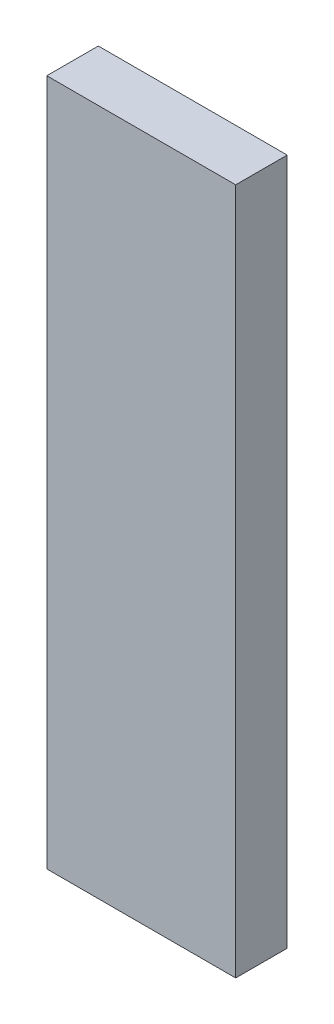
ISO-10303-21;
HEADER;
FILE_DESCRIPTION(('STEP AP214'),'2;1');
FILE_NAME('part.step','',(''),(''),'','','');
FILE_SCHEMA(('AUTOMOTIVE_DESIGN { 1 0 10303 214 1 1 1 1 }'));
ENDSEC;
DATA;
#1=APPLICATION_CONTEXT('core data for automotive mechanical design processes');
#2=APPLICATION_PROTOCOL_DEFINITION('international standard','automotive_design',2000,#1);
#3=PRODUCT_CONTEXT('',#1,'mechanical');
#4=PRODUCT('Part','Part','',(#3));
#5=PRODUCT_RELATED_PRODUCT_CATEGORY('part','',(#4));
#6=PRODUCT_DEFINITION_FORMATION('','',#4);
#7=PRODUCT_DEFINITION_CONTEXT('part definition',#1,'design');
#8=PRODUCT_DEFINITION('design','',#6,#7);
#9=PRODUCT_DEFINITION_SHAPE('','',#8);
#10=(LENGTH_UNIT() NAMED_UNIT(*) SI_UNIT(.MILLI.,.METRE.));
#11=(NAMED_UNIT(*) PLANE_ANGLE_UNIT() SI_UNIT($,.RADIAN.));
#12=(NAMED_UNIT(*) SI_UNIT($,.STERADIAN.) SOLID_ANGLE_UNIT());
#13=UNCERTAINTY_MEASURE_WITH_UNIT(LENGTH_MEASURE(1.E-05),#10,'distance_accuracy_value','');
#14=(GEOMETRIC_REPRESENTATION_CONTEXT(3) GLOBAL_UNCERTAINTY_ASSIGNED_CONTEXT((#13)) GLOBAL_UNIT_ASSIGNED_CONTEXT((#10,
#11,#12)) REPRESENTATION_CONTEXT('',''));
#15=CARTESIAN_POINT('',(0.,0.,0.));
#16=DIRECTION('',(0.,0.,1.));
#17=DIRECTION('',(1.,0.,0.));
#18=AXIS2_PLACEMENT_3D('',#15,#16,#17);
#19=CARTESIAN_POINT('',(0.,0.,3.));
#20=DIRECTION('',(1.,0.,0.));
#21=DIRECTION('',(0.,0.,-1.));
#22=AXIS2_PLACEMENT_3D('',#19,#20,#21);
#23=PLANE('',#22);
#24=DIRECTION('',(0.,-1.,0.));
#25=VECTOR('',#24,1.);
#26=CARTESIAN_POINT('',(0.,0.,0.));
#27=LINE('',#26,#25);
#28=CARTESIAN_POINT('',(0.,40.,0.));
#29=VERTEX_POINT('',#28);
#30=CARTESIAN_POINT('',(0.,0.,0.));
#31=VERTEX_POINT('',#30);
#32=EDGE_CURVE('E96',#29,#31,#27,.T.);
#33=ORIENTED_EDGE('',*,*,#32,.T.);
#34=DIRECTION('',(0.,0.,-1.));
#35=VECTOR('',#34,1.);
#36=CARTESIAN_POINT('',(0.,0.,3.));
#37=LINE('',#36,#35);
#38=CARTESIAN_POINT('',(0.,0.,3.));
#39=VERTEX_POINT('',#38);
#40=EDGE_CURVE('E11',#39,#31,#37,.T.);
#41=ORIENTED_EDGE('',*,*,#40,.F.);
#42=DIRECTION('',(0.,-1.,0.));
#43=VECTOR('',#42,1.);
#44=CARTESIAN_POINT('',(0.,0.,3.));
#45=LINE('',#44,#43);
#46=CARTESIAN_POINT('',(0.,40.,3.));
#47=VERTEX_POINT('',#46);
#48=EDGE_CURVE('E84',#47,#39,#45,.T.);
#49=ORIENTED_EDGE('',*,*,#48,.F.);
#50=DIRECTION('',(0.,0.,-1.));
#51=VECTOR('',#50,1.);
#52=CARTESIAN_POINT('',(0.,40.,3.));
#53=LINE('',#52,#51);
#54=EDGE_CURVE('E92',#47,#29,#53,.T.);
#55=ORIENTED_EDGE('',*,*,#54,.T.);
#56=EDGE_LOOP('',(#33,#41,#49,#55));
#57=FACE_BOUND('',#56,.T.);
#58=ADVANCED_FACE('F33',(#57),#23,.F.);
#59=CARTESIAN_POINT('',(0.,0.,3.));
#60=DIRECTION('',(0.,1.,0.));
#61=DIRECTION('',(0.,0.,1.));
#62=AXIS2_PLACEMENT_3D('',#59,#60,#61);
#63=PLANE('',#62);
#64=DIRECTION('',(1.,0.,0.));
#65=VECTOR('',#64,1.);
#66=CARTESIAN_POINT('',(0.,0.,0.));
#67=LINE('',#66,#65);
#68=CARTESIAN_POINT('',(11.,0.,0.));
#69=VERTEX_POINT('',#68);
#70=EDGE_CURVE('E88',#31,#69,#67,.T.);
#71=ORIENTED_EDGE('',*,*,#70,.T.);
#72=DIRECTION('',(0.,0.,-1.));
#73=VECTOR('',#72,1.);
#74=CARTESIAN_POINT('',(11.,0.,3.));
#75=LINE('',#74,#73);
#76=CARTESIAN_POINT('',(11.,0.,3.));
#77=VERTEX_POINT('',#76);
#78=EDGE_CURVE('E41',#77,#69,#75,.T.);
#79=ORIENTED_EDGE('',*,*,#78,.F.);
#80=DIRECTION('',(1.,0.,0.));
#81=VECTOR('',#80,1.);
#82=CARTESIAN_POINT('',(0.,0.,3.));
#83=LINE('',#82,#81);
#84=EDGE_CURVE('E79',#39,#77,#83,.T.);
#85=ORIENTED_EDGE('',*,*,#84,.F.);
#86=ORIENTED_EDGE('',*,*,#40,.T.);
#87=EDGE_LOOP('',(#71,#79,#85,#86));
#88=FACE_BOUND('',#87,.T.);
#89=ADVANCED_FACE('F87',(#88),#63,.F.);
#90=CARTESIAN_POINT('',(11.,0.,3.));
#91=DIRECTION('',(-1.,0.,0.));
#92=DIRECTION('',(0.,0.,1.));
#93=AXIS2_PLACEMENT_3D('',#90,#91,#92);
#94=PLANE('',#93);
#95=DIRECTION('',(0.,1.,0.));
#96=VECTOR('',#95,1.);
#97=CARTESIAN_POINT('',(11.,0.,0.));
#98=LINE('',#97,#96);
#99=CARTESIAN_POINT('',(11.,40.,0.));
#100=VERTEX_POINT('',#99);
#101=EDGE_CURVE('E66',#69,#100,#98,.T.);
#102=ORIENTED_EDGE('',*,*,#101,.T.);
#103=DIRECTION('',(0.,0.,-1.));
#104=VECTOR('',#103,1.);
#105=CARTESIAN_POINT('',(11.,40.,3.));
#106=LINE('',#105,#104);
#107=CARTESIAN_POINT('',(11.,40.,3.));
#108=VERTEX_POINT('',#107);
#109=EDGE_CURVE('E89',#108,#100,#106,.T.);
#110=ORIENTED_EDGE('',*,*,#109,.F.);
#111=DIRECTION('',(0.,1.,0.));
#112=VECTOR('',#111,1.);
#113=CARTESIAN_POINT('',(11.,0.,3.));
#114=LINE('',#113,#112);
#115=EDGE_CURVE('E82',#77,#108,#114,.T.);
#116=ORIENTED_EDGE('',*,*,#115,.F.);
#117=ORIENTED_EDGE('',*,*,#78,.T.);
#118=EDGE_LOOP('',(#102,#110,#116,#117));
#119=FACE_BOUND('',#118,.T.);
#120=ADVANCED_FACE('F90',(#119),#94,.F.);
#121=CARTESIAN_POINT('',(0.,40.,3.));
#122=DIRECTION('',(0.,-1.,0.));
#123=DIRECTION('',(0.,0.,-1.));
#124=AXIS2_PLACEMENT_3D('',#121,#122,#123);
#125=PLANE('',#124);
#126=DIRECTION('',(-1.,0.,0.));
#127=VECTOR('',#126,1.);
#128=CARTESIAN_POINT('',(0.,40.,0.));
#129=LINE('',#128,#127);
#130=EDGE_CURVE('E72',#100,#29,#129,.T.);
#131=ORIENTED_EDGE('',*,*,#130,.T.);
#132=ORIENTED_EDGE('',*,*,#54,.F.);
#133=DIRECTION('',(-1.,0.,0.));
#134=VECTOR('',#133,1.);
#135=CARTESIAN_POINT('',(0.,40.,3.));
#136=LINE('',#135,#134);
#137=EDGE_CURVE('E49',#108,#47,#136,.T.);
#138=ORIENTED_EDGE('',*,*,#137,.F.);
#139=ORIENTED_EDGE('',*,*,#109,.T.);
#140=EDGE_LOOP('',(#131,#132,#138,#139));
#141=FACE_BOUND('',#140,.T.);
#142=ADVANCED_FACE('F103',(#141),#125,.F.);
#143=CARTESIAN_POINT('',(0.,0.,3.));
#144=DIRECTION('',(0.,0.,-1.));
#145=DIRECTION('',(-1.,0.,0.));
#146=AXIS2_PLACEMENT_3D('',#143,#144,#145);
#147=PLANE('',#146);
#148=ORIENTED_EDGE('',*,*,#48,.T.);
#149=ORIENTED_EDGE('',*,*,#84,.T.);
#150=ORIENTED_EDGE('',*,*,#115,.T.);
#151=ORIENTED_EDGE('',*,*,#137,.T.);
#152=EDGE_LOOP('',(#148,#149,#150,#151));
#153=FACE_BOUND('',#152,.T.);
#154=ADVANCED_FACE('F80',(#153),#147,.F.);
#155=CARTESIAN_POINT('',(0.,0.,0.));
#156=DIRECTION('',(0.,0.,-1.));
#157=DIRECTION('',(-1.,0.,0.));
#158=AXIS2_PLACEMENT_3D('',#155,#156,#157);
#159=PLANE('',#158);
#160=ORIENTED_EDGE('',*,*,#32,.F.);
#161=ORIENTED_EDGE('',*,*,#130,.F.);
#162=ORIENTED_EDGE('',*,*,#101,.F.);
#163=ORIENTED_EDGE('',*,*,#70,.F.);
#164=EDGE_LOOP('',(#160,#161,#162,#163));
#165=FACE_BOUND('',#164,.T.);
#166=ADVANCED_FACE('F106',(#165),#159,.T.);
#167=CLOSED_SHELL('',(#58,#89,#120,#142,#154,#166));
#168=MANIFOLD_SOLID_BREP('B2',#167);
#169=ADVANCED_BREP_SHAPE_REPRESENTATION('',(#18,#168),#14);
#170=SHAPE_DEFINITION_REPRESENTATION(#9,#169);
ENDSEC;
END-ISO-10303-21;
